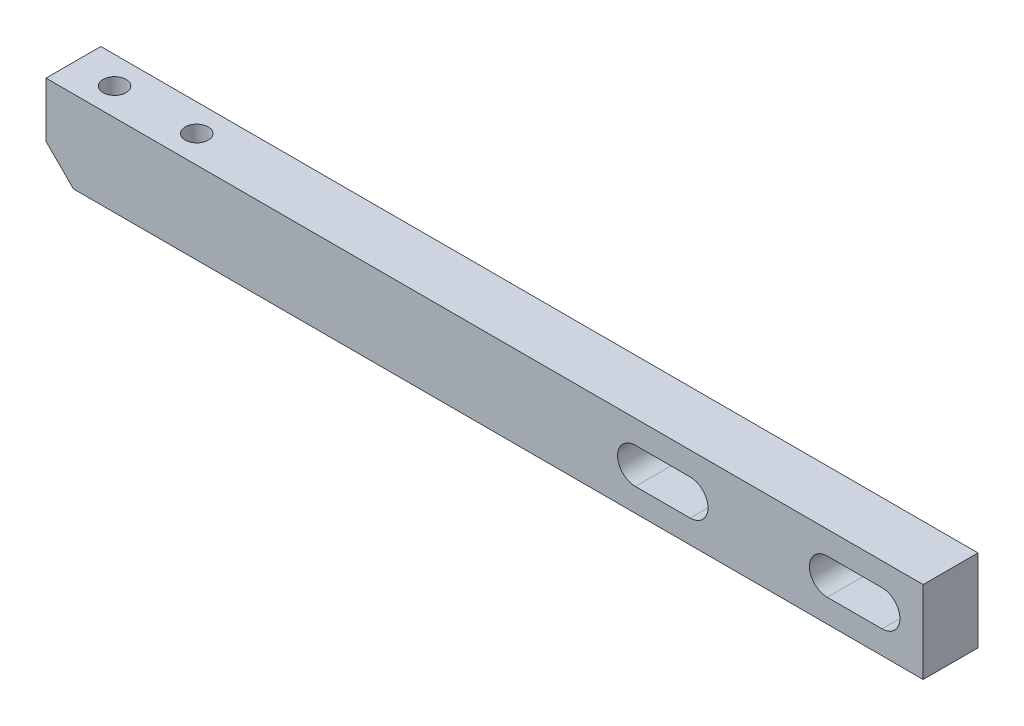
ISO-10303-21;
HEADER;
FILE_DESCRIPTION(('STEP AP214'),'2;1');
FILE_NAME('part.step','',(''),(''),'','','');
FILE_SCHEMA(('AUTOMOTIVE_DESIGN { 1 0 10303 214 1 1 1 1 }'));
ENDSEC;
DATA;
#1=APPLICATION_CONTEXT('core data for automotive mechanical design processes');
#2=APPLICATION_PROTOCOL_DEFINITION('international standard','automotive_design',2000,#1);
#3=PRODUCT_CONTEXT('',#1,'mechanical');
#4=PRODUCT('Part','Part','',(#3));
#5=PRODUCT_RELATED_PRODUCT_CATEGORY('part','',(#4));
#6=PRODUCT_DEFINITION_FORMATION('','',#4);
#7=PRODUCT_DEFINITION_CONTEXT('part definition',#1,'design');
#8=PRODUCT_DEFINITION('design','',#6,#7);
#9=PRODUCT_DEFINITION_SHAPE('','',#8);
#10=(LENGTH_UNIT() NAMED_UNIT(*) SI_UNIT(.MILLI.,.METRE.));
#11=(NAMED_UNIT(*) PLANE_ANGLE_UNIT() SI_UNIT($,.RADIAN.));
#12=(NAMED_UNIT(*) SI_UNIT($,.STERADIAN.) SOLID_ANGLE_UNIT());
#13=UNCERTAINTY_MEASURE_WITH_UNIT(LENGTH_MEASURE(1.E-05),#10,'distance_accuracy_value','');
#14=(GEOMETRIC_REPRESENTATION_CONTEXT(3) GLOBAL_UNCERTAINTY_ASSIGNED_CONTEXT((#13)) GLOBAL_UNIT_ASSIGNED_CONTEXT((#10,
#11,#12)) REPRESENTATION_CONTEXT('',''));
#15=CARTESIAN_POINT('',(0.,0.,0.));
#16=DIRECTION('',(0.,0.,1.));
#17=DIRECTION('',(1.,0.,0.));
#18=AXIS2_PLACEMENT_3D('',#15,#16,#17);
#19=CARTESIAN_POINT('',(0.,0.,10.));
#20=DIRECTION('',(1.,0.,0.));
#21=DIRECTION('',(0.,0.,-1.));
#22=AXIS2_PLACEMENT_3D('',#19,#20,#21);
#23=PLANE('',#22);
#24=DIRECTION('',(0.,-1.,0.));
#25=VECTOR('',#24,1.);
#26=CARTESIAN_POINT('',(0.,0.,0.));
#27=LINE('',#26,#25);
#28=CARTESIAN_POINT('',(0.,15.,0.));
#29=VERTEX_POINT('',#28);
#30=CARTESIAN_POINT('',(0.,5.,0.));
#31=VERTEX_POINT('',#30);
#32=EDGE_CURVE('E219',#29,#31,#27,.T.);
#33=ORIENTED_EDGE('',*,*,#32,.T.);
#34=DIRECTION('',(0.,0.,1.));
#35=VECTOR('',#34,1.);
#36=CARTESIAN_POINT('',(0.,5.,10.));
#37=LINE('',#36,#35);
#38=CARTESIAN_POINT('',(0.,5.,10.));
#39=VERTEX_POINT('',#38);
#40=EDGE_CURVE('E47',#31,#39,#37,.T.);
#41=ORIENTED_EDGE('',*,*,#40,.T.);
#42=DIRECTION('',(0.,-1.,0.));
#43=VECTOR('',#42,1.);
#44=CARTESIAN_POINT('',(0.,0.,10.));
#45=LINE('',#44,#43);
#46=CARTESIAN_POINT('',(0.,15.,10.));
#47=VERTEX_POINT('',#46);
#48=EDGE_CURVE('E220',#47,#39,#45,.T.);
#49=ORIENTED_EDGE('',*,*,#48,.F.);
#50=DIRECTION('',(0.,0.,-1.));
#51=VECTOR('',#50,1.);
#52=CARTESIAN_POINT('',(0.,15.,10.));
#53=LINE('',#52,#51);
#54=EDGE_CURVE('E230',#47,#29,#53,.T.);
#55=ORIENTED_EDGE('',*,*,#54,.T.);
#56=EDGE_LOOP('',(#33,#41,#49,#55));
#57=FACE_BOUND('',#56,.T.);
#58=ADVANCED_FACE('F39',(#57),#23,.F.);
#59=CARTESIAN_POINT('',(0.,0.,10.));
#60=DIRECTION('',(0.,1.,0.));
#61=DIRECTION('',(0.,0.,1.));
#62=AXIS2_PLACEMENT_3D('',#59,#60,#61);
#63=PLANE('',#62);
#64=DIRECTION('',(1.,0.,0.));
#65=VECTOR('',#64,1.);
#66=CARTESIAN_POINT('',(0.,0.,10.));
#67=LINE('',#66,#65);
#68=CARTESIAN_POINT('',(4.99999999999999,0.,10.));
#69=VERTEX_POINT('',#68);
#70=CARTESIAN_POINT('',(160.,0.,10.));
#71=VERTEX_POINT('',#70);
#72=EDGE_CURVE('E223',#69,#71,#67,.T.);
#73=ORIENTED_EDGE('',*,*,#72,.F.);
#74=DIRECTION('',(0.,0.,-1.));
#75=VECTOR('',#74,1.);
#76=CARTESIAN_POINT('',(4.99999999999999,0.,10.));
#77=LINE('',#76,#75);
#78=CARTESIAN_POINT('',(4.99999999999999,0.,0.));
#79=VERTEX_POINT('',#78);
#80=EDGE_CURVE('E246',#69,#79,#77,.T.);
#81=ORIENTED_EDGE('',*,*,#80,.T.);
#82=DIRECTION('',(1.,0.,0.));
#83=VECTOR('',#82,1.);
#84=CARTESIAN_POINT('',(0.,0.,0.));
#85=LINE('',#84,#83);
#86=CARTESIAN_POINT('',(160.,0.,0.));
#87=VERTEX_POINT('',#86);
#88=EDGE_CURVE('E233',#79,#87,#85,.T.);
#89=ORIENTED_EDGE('',*,*,#88,.T.);
#90=DIRECTION('',(0.,0.,-1.));
#91=VECTOR('',#90,1.);
#92=CARTESIAN_POINT('',(160.,0.,10.));
#93=LINE('',#92,#91);
#94=EDGE_CURVE('E243',#71,#87,#93,.T.);
#95=ORIENTED_EDGE('',*,*,#94,.F.);
#96=EDGE_LOOP('',(#73,#81,#89,#95));
#97=FACE_BOUND('',#96,.T.);
#98=ADVANCED_FACE('F263',(#97),#63,.F.);
#99=CARTESIAN_POINT('',(160.,0.,10.));
#100=DIRECTION('',(-1.,0.,0.));
#101=DIRECTION('',(0.,0.,1.));
#102=AXIS2_PLACEMENT_3D('',#99,#100,#101);
#103=PLANE('',#102);
#104=DIRECTION('',(0.,1.,0.));
#105=VECTOR('',#104,1.);
#106=CARTESIAN_POINT('',(160.,0.,0.));
#107=LINE('',#106,#105);
#108=CARTESIAN_POINT('',(160.,15.,0.));
#109=VERTEX_POINT('',#108);
#110=EDGE_CURVE('E235',#87,#109,#107,.T.);
#111=ORIENTED_EDGE('',*,*,#110,.T.);
#112=DIRECTION('',(0.,0.,-1.));
#113=VECTOR('',#112,1.);
#114=CARTESIAN_POINT('',(160.,15.,10.));
#115=LINE('',#114,#113);
#116=CARTESIAN_POINT('',(160.,15.,10.));
#117=VERTEX_POINT('',#116);
#118=EDGE_CURVE('E240',#117,#109,#115,.T.);
#119=ORIENTED_EDGE('',*,*,#118,.F.);
#120=DIRECTION('',(0.,1.,0.));
#121=VECTOR('',#120,1.);
#122=CARTESIAN_POINT('',(160.,0.,10.));
#123=LINE('',#122,#121);
#124=EDGE_CURVE('E226',#71,#117,#123,.T.);
#125=ORIENTED_EDGE('',*,*,#124,.F.);
#126=ORIENTED_EDGE('',*,*,#94,.T.);
#127=EDGE_LOOP('',(#111,#119,#125,#126));
#128=FACE_BOUND('',#127,.T.);
#129=ADVANCED_FACE('F271',(#128),#103,.F.);
#130=CARTESIAN_POINT('',(0.,15.,10.));
#131=DIRECTION('',(0.,-1.,0.));
#132=DIRECTION('',(0.,0.,-1.));
#133=AXIS2_PLACEMENT_3D('',#130,#131,#132);
#134=PLANE('',#133);
#135=CARTESIAN_POINT('',(7.5,15.,5.));
#136=DIRECTION('',(0.,1.,0.));
#137=DIRECTION('',(0.,0.,1.));
#138=AXIS2_PLACEMENT_3D('',#135,#136,#137);
#139=CIRCLE('',#138,2.1);
#140=CARTESIAN_POINT('',(7.5,15.,7.1));
#141=VERTEX_POINT('',#140);
#142=EDGE_CURVE('E201',#141,#141,#139,.T.);
#143=ORIENTED_EDGE('',*,*,#142,.F.);
#144=EDGE_LOOP('',(#143));
#145=FACE_BOUND('',#144,.T.);
#146=CARTESIAN_POINT('',(22.5,15.,5.));
#147=DIRECTION('',(0.,1.,0.));
#148=DIRECTION('',(0.,0.,1.));
#149=AXIS2_PLACEMENT_3D('',#146,#147,#148);
#150=CIRCLE('',#149,2.1);
#151=CARTESIAN_POINT('',(22.5,15.,7.1));
#152=VERTEX_POINT('',#151);
#153=EDGE_CURVE('E213',#152,#152,#150,.T.);
#154=ORIENTED_EDGE('',*,*,#153,.F.);
#155=EDGE_LOOP('',(#154));
#156=FACE_BOUND('',#155,.T.);
#157=DIRECTION('',(-1.,0.,0.));
#158=VECTOR('',#157,1.);
#159=CARTESIAN_POINT('',(0.,15.,0.));
#160=LINE('',#159,#158);
#161=EDGE_CURVE('E224',#109,#29,#160,.T.);
#162=ORIENTED_EDGE('',*,*,#161,.T.);
#163=ORIENTED_EDGE('',*,*,#54,.F.);
#164=DIRECTION('',(-1.,0.,0.));
#165=VECTOR('',#164,1.);
#166=CARTESIAN_POINT('',(0.,15.,10.));
#167=LINE('',#166,#165);
#168=EDGE_CURVE('E228',#117,#47,#167,.T.);
#169=ORIENTED_EDGE('',*,*,#168,.F.);
#170=ORIENTED_EDGE('',*,*,#118,.T.);
#171=EDGE_LOOP('',(#162,#163,#169,#170));
#172=FACE_BOUND('',#171,.T.);
#173=ADVANCED_FACE('F274',(#145,#156,#172),#134,.F.);
#174=CARTESIAN_POINT('',(0.,0.,10.));
#175=DIRECTION('',(0.,0.,-1.));
#176=DIRECTION('',(-1.,0.,0.));
#177=AXIS2_PLACEMENT_3D('',#174,#175,#176);
#178=PLANE('',#177);
#179=DIRECTION('',(1.,0.,0.));
#180=VECTOR('',#179,1.);
#181=CARTESIAN_POINT('',(117.5,10.75,10.));
#182=LINE('',#181,#180);
#183=CARTESIAN_POINT('',(107.5,10.75,10.));
#184=VERTEX_POINT('',#183);
#185=CARTESIAN_POINT('',(117.5,10.75,10.));
#186=VERTEX_POINT('',#185);
#187=EDGE_CURVE('E147',#184,#186,#182,.T.);
#188=ORIENTED_EDGE('',*,*,#187,.T.);
#189=CARTESIAN_POINT('',(117.5,7.5,10.));
#190=DIRECTION('',(0.,0.,-1.));
#191=DIRECTION('',(-1.,0.,0.));
#192=AXIS2_PLACEMENT_3D('',#189,#190,#191);
#193=CIRCLE('',#192,3.25);
#194=CARTESIAN_POINT('',(117.5,4.25,10.));
#195=VERTEX_POINT('',#194);
#196=EDGE_CURVE('E141',#186,#195,#193,.T.);
#197=ORIENTED_EDGE('',*,*,#196,.T.);
#198=DIRECTION('',(-1.,0.,0.));
#199=VECTOR('',#198,1.);
#200=CARTESIAN_POINT('',(117.5,4.25,10.));
#201=LINE('',#200,#199);
#202=CARTESIAN_POINT('',(107.5,4.25000000000001,10.));
#203=VERTEX_POINT('',#202);
#204=EDGE_CURVE('E150',#195,#203,#201,.T.);
#205=ORIENTED_EDGE('',*,*,#204,.T.);
#206=CARTESIAN_POINT('',(107.5,7.5,10.));
#207=DIRECTION('',(0.,0.,-1.));
#208=DIRECTION('',(-1.,0.,0.));
#209=AXIS2_PLACEMENT_3D('',#206,#207,#208);
#210=CIRCLE('',#209,3.25);
#211=EDGE_CURVE('E54',#203,#184,#210,.T.);
#212=ORIENTED_EDGE('',*,*,#211,.T.);
#213=EDGE_LOOP('',(#188,#197,#205,#212));
#214=FACE_BOUND('',#213,.T.);
#215=DIRECTION('',(1.,0.,0.));
#216=VECTOR('',#215,1.);
#217=CARTESIAN_POINT('',(152.5,10.75,10.));
#218=LINE('',#217,#216);
#219=CARTESIAN_POINT('',(142.5,10.75,10.));
#220=VERTEX_POINT('',#219);
#221=CARTESIAN_POINT('',(152.5,10.75,10.));
#222=VERTEX_POINT('',#221);
#223=EDGE_CURVE('E186',#220,#222,#218,.T.);
#224=ORIENTED_EDGE('',*,*,#223,.T.);
#225=CARTESIAN_POINT('',(152.5,7.5,10.));
#226=DIRECTION('',(0.,0.,-1.));
#227=DIRECTION('',(-1.,0.,0.));
#228=AXIS2_PLACEMENT_3D('',#225,#226,#227);
#229=CIRCLE('',#228,3.25);
#230=CARTESIAN_POINT('',(152.5,4.25,10.));
#231=VERTEX_POINT('',#230);
#232=EDGE_CURVE('E176',#222,#231,#229,.T.);
#233=ORIENTED_EDGE('',*,*,#232,.T.);
#234=DIRECTION('',(-1.,0.,0.));
#235=VECTOR('',#234,1.);
#236=CARTESIAN_POINT('',(152.5,4.25,10.));
#237=LINE('',#236,#235);
#238=CARTESIAN_POINT('',(142.5,4.25,10.));
#239=VERTEX_POINT('',#238);
#240=EDGE_CURVE('E179',#231,#239,#237,.T.);
#241=ORIENTED_EDGE('',*,*,#240,.T.);
#242=CARTESIAN_POINT('',(142.5,7.5,10.));
#243=DIRECTION('',(0.,0.,-1.));
#244=DIRECTION('',(-1.,0.,0.));
#245=AXIS2_PLACEMENT_3D('',#242,#243,#244);
#246=CIRCLE('',#245,3.25);
#247=EDGE_CURVE('E183',#239,#220,#246,.T.);
#248=ORIENTED_EDGE('',*,*,#247,.T.);
#249=EDGE_LOOP('',(#224,#233,#241,#248));
#250=FACE_BOUND('',#249,.T.);
#251=ORIENTED_EDGE('',*,*,#48,.T.);
#252=DIRECTION('',(-0.707106781186547,0.707106781186549,0.));
#253=VECTOR('',#252,1.);
#254=CARTESIAN_POINT('',(4.99999999999999,0.,10.));
#255=LINE('',#254,#253);
#256=EDGE_CURVE('E11',#39,#69,#255,.F.);
#257=ORIENTED_EDGE('',*,*,#256,.T.);
#258=ORIENTED_EDGE('',*,*,#72,.T.);
#259=ORIENTED_EDGE('',*,*,#124,.T.);
#260=ORIENTED_EDGE('',*,*,#168,.T.);
#261=EDGE_LOOP('',(#251,#257,#258,#259,#260));
#262=FACE_BOUND('',#261,.T.);
#263=ADVANCED_FACE('F154',(#214,#250,#262),#178,.F.);
#264=CARTESIAN_POINT('',(0.,0.,0.));
#265=DIRECTION('',(0.,0.,-1.));
#266=DIRECTION('',(-1.,0.,0.));
#267=AXIS2_PLACEMENT_3D('',#264,#265,#266);
#268=PLANE('',#267);
#269=CARTESIAN_POINT('',(117.5,7.5,0.));
#270=DIRECTION('',(0.,0.,-1.));
#271=DIRECTION('',(-1.,0.,0.));
#272=AXIS2_PLACEMENT_3D('',#269,#270,#271);
#273=CIRCLE('',#272,3.25);
#274=CARTESIAN_POINT('',(117.5,10.75,0.));
#275=VERTEX_POINT('',#274);
#276=CARTESIAN_POINT('',(117.5,4.25,0.));
#277=VERTEX_POINT('',#276);
#278=EDGE_CURVE('E62',#275,#277,#273,.T.);
#279=ORIENTED_EDGE('',*,*,#278,.F.);
#280=DIRECTION('',(1.,0.,0.));
#281=VECTOR('',#280,1.);
#282=CARTESIAN_POINT('',(117.5,10.75,0.));
#283=LINE('',#282,#281);
#284=CARTESIAN_POINT('',(107.5,10.75,0.));
#285=VERTEX_POINT('',#284);
#286=EDGE_CURVE('E157',#285,#275,#283,.T.);
#287=ORIENTED_EDGE('',*,*,#286,.F.);
#288=CARTESIAN_POINT('',(107.5,7.5,0.));
#289=DIRECTION('',(0.,0.,-1.));
#290=DIRECTION('',(-1.,0.,0.));
#291=AXIS2_PLACEMENT_3D('',#288,#289,#290);
#292=CIRCLE('',#291,3.25);
#293=CARTESIAN_POINT('',(107.5,4.25,0.));
#294=VERTEX_POINT('',#293);
#295=EDGE_CURVE('E160',#294,#285,#292,.T.);
#296=ORIENTED_EDGE('',*,*,#295,.F.);
#297=DIRECTION('',(-1.,0.,0.));
#298=VECTOR('',#297,1.);
#299=CARTESIAN_POINT('',(117.5,4.25,0.));
#300=LINE('',#299,#298);
#301=EDGE_CURVE('E166',#277,#294,#300,.T.);
#302=ORIENTED_EDGE('',*,*,#301,.F.);
#303=EDGE_LOOP('',(#279,#287,#296,#302));
#304=FACE_BOUND('',#303,.T.);
#305=CARTESIAN_POINT('',(152.5,7.5,0.));
#306=DIRECTION('',(0.,0.,-1.));
#307=DIRECTION('',(-1.,0.,0.));
#308=AXIS2_PLACEMENT_3D('',#305,#306,#307);
#309=CIRCLE('',#308,3.25);
#310=CARTESIAN_POINT('',(152.5,10.75,0.));
#311=VERTEX_POINT('',#310);
#312=CARTESIAN_POINT('',(152.5,4.25,0.));
#313=VERTEX_POINT('',#312);
#314=EDGE_CURVE('E172',#311,#313,#309,.T.);
#315=ORIENTED_EDGE('',*,*,#314,.F.);
#316=DIRECTION('',(1.,0.,0.));
#317=VECTOR('',#316,1.);
#318=CARTESIAN_POINT('',(152.5,10.75,0.));
#319=LINE('',#318,#317);
#320=CARTESIAN_POINT('',(142.5,10.75,0.));
#321=VERTEX_POINT('',#320);
#322=EDGE_CURVE('E180',#321,#311,#319,.T.);
#323=ORIENTED_EDGE('',*,*,#322,.F.);
#324=CARTESIAN_POINT('',(142.5,7.5,0.));
#325=DIRECTION('',(0.,0.,-1.));
#326=DIRECTION('',(-1.,0.,0.));
#327=AXIS2_PLACEMENT_3D('',#324,#325,#326);
#328=CIRCLE('',#327,3.25);
#329=CARTESIAN_POINT('',(142.5,4.25,0.));
#330=VERTEX_POINT('',#329);
#331=EDGE_CURVE('E194',#330,#321,#328,.T.);
#332=ORIENTED_EDGE('',*,*,#331,.F.);
#333=DIRECTION('',(-1.,0.,0.));
#334=VECTOR('',#333,1.);
#335=CARTESIAN_POINT('',(152.5,4.25,0.));
#336=LINE('',#335,#334);
#337=EDGE_CURVE('E191',#313,#330,#336,.T.);
#338=ORIENTED_EDGE('',*,*,#337,.F.);
#339=EDGE_LOOP('',(#315,#323,#332,#338));
#340=FACE_BOUND('',#339,.T.);
#341=ORIENTED_EDGE('',*,*,#88,.F.);
#342=DIRECTION('',(0.707106781186547,-0.707106781186549,0.));
#343=VECTOR('',#342,1.);
#344=CARTESIAN_POINT('',(2.5,2.5,0.));
#345=LINE('',#344,#343);
#346=EDGE_CURVE('E249',#79,#31,#345,.F.);
#347=ORIENTED_EDGE('',*,*,#346,.T.);
#348=ORIENTED_EDGE('',*,*,#32,.F.);
#349=ORIENTED_EDGE('',*,*,#161,.F.);
#350=ORIENTED_EDGE('',*,*,#110,.F.);
#351=EDGE_LOOP('',(#341,#347,#348,#349,#350));
#352=FACE_BOUND('',#351,.T.);
#353=ADVANCED_FACE('F267',(#304,#340,#352),#268,.T.);
#354=CARTESIAN_POINT('',(22.5,2.,5.));
#355=DIRECTION('',(0.,1.,0.));
#356=DIRECTION('',(0.,0.,1.));
#357=AXIS2_PLACEMENT_3D('',#354,#355,#356);
#358=CONICAL_SURFACE('',#357,2.1,1.02974425867665);
#359=CARTESIAN_POINT('',(22.5,0.738192700042122,5.));
#360=VERTEX_POINT('',#359);
#361=VERTEX_LOOP('',#360);
#362=FACE_BOUND('',#361,.T.);
#363=CARTESIAN_POINT('',(22.5,2.,5.));
#364=DIRECTION('',(0.,1.,0.));
#365=DIRECTION('',(0.,0.,1.));
#366=AXIS2_PLACEMENT_3D('',#363,#364,#365);
#367=CIRCLE('',#366,2.1);
#368=CARTESIAN_POINT('',(22.5,2.,7.1));
#369=VERTEX_POINT('',#368);
#370=EDGE_CURVE('E216',#369,#369,#367,.T.);
#371=ORIENTED_EDGE('',*,*,#370,.T.);
#372=EDGE_LOOP('',(#371));
#373=FACE_BOUND('',#372,.T.);
#374=ADVANCED_FACE('F309',(#362,#373),#358,.F.);
#375=CARTESIAN_POINT('',(22.5,15.,5.));
#376=DIRECTION('',(0.,1.,0.));
#377=DIRECTION('',(0.,0.,1.));
#378=AXIS2_PLACEMENT_3D('',#375,#376,#377);
#379=CYLINDRICAL_SURFACE('',#378,2.1);
#380=ORIENTED_EDGE('',*,*,#370,.F.);
#381=EDGE_LOOP('',(#380));
#382=FACE_BOUND('',#381,.T.);
#383=ORIENTED_EDGE('',*,*,#153,.T.);
#384=EDGE_LOOP('',(#383));
#385=FACE_BOUND('',#384,.T.);
#386=ADVANCED_FACE('F314',(#382,#385),#379,.F.);
#387=CARTESIAN_POINT('',(7.5,2.,5.));
#388=DIRECTION('',(0.,1.,0.));
#389=DIRECTION('',(0.,0.,1.));
#390=AXIS2_PLACEMENT_3D('',#387,#388,#389);
#391=CONICAL_SURFACE('',#390,2.1,1.02974425867665);
#392=CARTESIAN_POINT('',(7.5,0.738192700042122,5.));
#393=VERTEX_POINT('',#392);
#394=VERTEX_LOOP('',#393);
#395=FACE_BOUND('',#394,.T.);
#396=CARTESIAN_POINT('',(7.5,2.,5.));
#397=DIRECTION('',(0.,1.,0.));
#398=DIRECTION('',(0.,0.,1.));
#399=AXIS2_PLACEMENT_3D('',#396,#397,#398);
#400=CIRCLE('',#399,2.1);
#401=CARTESIAN_POINT('',(7.5,2.,7.1));
#402=VERTEX_POINT('',#401);
#403=EDGE_CURVE('E210',#402,#402,#400,.T.);
#404=ORIENTED_EDGE('',*,*,#403,.T.);
#405=EDGE_LOOP('',(#404));
#406=FACE_BOUND('',#405,.T.);
#407=ADVANCED_FACE('F327',(#395,#406),#391,.F.);
#408=CARTESIAN_POINT('',(7.5,15.,5.));
#409=DIRECTION('',(0.,1.,0.));
#410=DIRECTION('',(0.,0.,1.));
#411=AXIS2_PLACEMENT_3D('',#408,#409,#410);
#412=CYLINDRICAL_SURFACE('',#411,2.1);
#413=ORIENTED_EDGE('',*,*,#403,.F.);
#414=EDGE_LOOP('',(#413));
#415=FACE_BOUND('',#414,.T.);
#416=ORIENTED_EDGE('',*,*,#142,.T.);
#417=EDGE_LOOP('',(#416));
#418=FACE_BOUND('',#417,.T.);
#419=ADVANCED_FACE('F339',(#415,#418),#412,.F.);
#420=CARTESIAN_POINT('',(4.99999999999999,0.,10.));
#421=DIRECTION('',(0.707106781186548,0.707106781186546,0.));
#422=DIRECTION('',(0.,0.,-1.));
#423=AXIS2_PLACEMENT_3D('',#420,#421,#422);
#424=PLANE('',#423);
#425=ORIENTED_EDGE('',*,*,#256,.F.);
#426=ORIENTED_EDGE('',*,*,#40,.F.);
#427=ORIENTED_EDGE('',*,*,#346,.F.);
#428=ORIENTED_EDGE('',*,*,#80,.F.);
#429=EDGE_LOOP('',(#425,#426,#427,#428));
#430=FACE_BOUND('',#429,.T.);
#431=ADVANCED_FACE('F41',(#430),#424,.F.);
#432=CARTESIAN_POINT('',(152.5,7.5,10.));
#433=DIRECTION('',(0.,0.,-1.));
#434=DIRECTION('',(-1.,0.,0.));
#435=AXIS2_PLACEMENT_3D('',#432,#433,#434);
#436=CYLINDRICAL_SURFACE('',#435,3.25);
#437=ORIENTED_EDGE('',*,*,#314,.T.);
#438=DIRECTION('',(0.,0.,-1.));
#439=VECTOR('',#438,1.);
#440=CARTESIAN_POINT('',(152.5,4.25,10.));
#441=LINE('',#440,#439);
#442=EDGE_CURVE('E189',#231,#313,#441,.T.);
#443=ORIENTED_EDGE('',*,*,#442,.F.);
#444=ORIENTED_EDGE('',*,*,#232,.F.);
#445=DIRECTION('',(0.,0.,-1.));
#446=VECTOR('',#445,1.);
#447=CARTESIAN_POINT('',(152.5,10.75,10.));
#448=LINE('',#447,#446);
#449=EDGE_CURVE('E199',#222,#311,#448,.T.);
#450=ORIENTED_EDGE('',*,*,#449,.T.);
#451=EDGE_LOOP('',(#437,#443,#444,#450));
#452=FACE_BOUND('',#451,.T.);
#453=ADVANCED_FACE('F368',(#452),#436,.F.);
#454=CARTESIAN_POINT('',(152.5,10.75,10.));
#455=DIRECTION('',(0.,1.,0.));
#456=DIRECTION('',(0.,0.,1.));
#457=AXIS2_PLACEMENT_3D('',#454,#455,#456);
#458=PLANE('',#457);
#459=ORIENTED_EDGE('',*,*,#322,.T.);
#460=ORIENTED_EDGE('',*,*,#449,.F.);
#461=ORIENTED_EDGE('',*,*,#223,.F.);
#462=DIRECTION('',(0.,0.,-1.));
#463=VECTOR('',#462,1.);
#464=CARTESIAN_POINT('',(142.5,10.75,10.));
#465=LINE('',#464,#463);
#466=EDGE_CURVE('E202',#220,#321,#465,.T.);
#467=ORIENTED_EDGE('',*,*,#466,.T.);
#468=EDGE_LOOP('',(#459,#460,#461,#467));
#469=FACE_BOUND('',#468,.T.);
#470=ADVANCED_FACE('F374',(#469),#458,.F.);
#471=CARTESIAN_POINT('',(142.5,7.5,10.));
#472=DIRECTION('',(0.,0.,-1.));
#473=DIRECTION('',(-1.,0.,0.));
#474=AXIS2_PLACEMENT_3D('',#471,#472,#473);
#475=CYLINDRICAL_SURFACE('',#474,3.25);
#476=ORIENTED_EDGE('',*,*,#331,.T.);
#477=ORIENTED_EDGE('',*,*,#466,.F.);
#478=ORIENTED_EDGE('',*,*,#247,.F.);
#479=DIRECTION('',(0.,0.,-1.));
#480=VECTOR('',#479,1.);
#481=CARTESIAN_POINT('',(142.5,4.25,10.));
#482=LINE('',#481,#480);
#483=EDGE_CURVE('E204',#239,#330,#482,.T.);
#484=ORIENTED_EDGE('',*,*,#483,.T.);
#485=EDGE_LOOP('',(#476,#477,#478,#484));
#486=FACE_BOUND('',#485,.T.);
#487=ADVANCED_FACE('F383',(#486),#475,.F.);
#488=CARTESIAN_POINT('',(152.5,4.25,10.));
#489=DIRECTION('',(0.,-1.,0.));
#490=DIRECTION('',(1.,0.,0.));
#491=AXIS2_PLACEMENT_3D('',#488,#489,#490);
#492=PLANE('',#491);
#493=ORIENTED_EDGE('',*,*,#337,.T.);
#494=ORIENTED_EDGE('',*,*,#483,.F.);
#495=ORIENTED_EDGE('',*,*,#240,.F.);
#496=ORIENTED_EDGE('',*,*,#442,.T.);
#497=EDGE_LOOP('',(#493,#494,#495,#496));
#498=FACE_BOUND('',#497,.T.);
#499=ADVANCED_FACE('F391',(#498),#492,.F.);
#500=CARTESIAN_POINT('',(117.5,7.5,10.));
#501=DIRECTION('',(0.,0.,-1.));
#502=DIRECTION('',(-1.,0.,0.));
#503=AXIS2_PLACEMENT_3D('',#500,#501,#502);
#504=CYLINDRICAL_SURFACE('',#503,3.25);
#505=ORIENTED_EDGE('',*,*,#278,.T.);
#506=DIRECTION('',(0.,0.,-1.));
#507=VECTOR('',#506,1.);
#508=CARTESIAN_POINT('',(117.5,4.25,10.));
#509=LINE('',#508,#507);
#510=EDGE_CURVE('E137',#195,#277,#509,.T.);
#511=ORIENTED_EDGE('',*,*,#510,.F.);
#512=ORIENTED_EDGE('',*,*,#196,.F.);
#513=DIRECTION('',(0.,0.,-1.));
#514=VECTOR('',#513,1.);
#515=CARTESIAN_POINT('',(117.5,10.75,10.));
#516=LINE('',#515,#514);
#517=EDGE_CURVE('E170',#186,#275,#516,.T.);
#518=ORIENTED_EDGE('',*,*,#517,.T.);
#519=EDGE_LOOP('',(#505,#511,#512,#518));
#520=FACE_BOUND('',#519,.T.);
#521=ADVANCED_FACE('F139',(#520),#504,.F.);
#522=CARTESIAN_POINT('',(117.5,10.75,10.));
#523=DIRECTION('',(0.,1.,0.));
#524=DIRECTION('',(-1.,0.,0.));
#525=AXIS2_PLACEMENT_3D('',#522,#523,#524);
#526=PLANE('',#525);
#527=ORIENTED_EDGE('',*,*,#286,.T.);
#528=ORIENTED_EDGE('',*,*,#517,.F.);
#529=ORIENTED_EDGE('',*,*,#187,.F.);
#530=DIRECTION('',(0.,0.,-1.));
#531=VECTOR('',#530,1.);
#532=CARTESIAN_POINT('',(107.5,10.75,10.));
#533=LINE('',#532,#531);
#534=EDGE_CURVE('E173',#184,#285,#533,.T.);
#535=ORIENTED_EDGE('',*,*,#534,.T.);
#536=EDGE_LOOP('',(#527,#528,#529,#535));
#537=FACE_BOUND('',#536,.T.);
#538=ADVANCED_FACE('F406',(#537),#526,.F.);
#539=CARTESIAN_POINT('',(107.5,7.5,10.));
#540=DIRECTION('',(0.,0.,-1.));
#541=DIRECTION('',(-1.,0.,0.));
#542=AXIS2_PLACEMENT_3D('',#539,#540,#541);
#543=CYLINDRICAL_SURFACE('',#542,3.25);
#544=ORIENTED_EDGE('',*,*,#295,.T.);
#545=ORIENTED_EDGE('',*,*,#534,.F.);
#546=ORIENTED_EDGE('',*,*,#211,.F.);
#547=DIRECTION('',(0.,0.,-1.));
#548=VECTOR('',#547,1.);
#549=CARTESIAN_POINT('',(107.5,4.25,10.));
#550=LINE('',#549,#548);
#551=EDGE_CURVE('E146',#203,#294,#550,.T.);
#552=ORIENTED_EDGE('',*,*,#551,.T.);
#553=EDGE_LOOP('',(#544,#545,#546,#552));
#554=FACE_BOUND('',#553,.T.);
#555=ADVANCED_FACE('F413',(#554),#543,.F.);
#556=CARTESIAN_POINT('',(117.5,4.25,10.));
#557=DIRECTION('',(0.,-1.,0.));
#558=DIRECTION('',(1.,0.,0.));
#559=AXIS2_PLACEMENT_3D('',#556,#557,#558);
#560=PLANE('',#559);
#561=ORIENTED_EDGE('',*,*,#301,.T.);
#562=ORIENTED_EDGE('',*,*,#551,.F.);
#563=ORIENTED_EDGE('',*,*,#204,.F.);
#564=ORIENTED_EDGE('',*,*,#510,.T.);
#565=EDGE_LOOP('',(#561,#562,#563,#564));
#566=FACE_BOUND('',#565,.T.);
#567=ADVANCED_FACE('F151',(#566),#560,.F.);
#568=CLOSED_SHELL('',(#58,#98,#129,#173,#263,#353,#374,#386,#407,#419,#431,#453,#470,#487,#499,
#521,#538,#555,#567));
#569=MANIFOLD_SOLID_BREP('B2',#568);
#570=ADVANCED_BREP_SHAPE_REPRESENTATION('',(#18,#569),#14);
#571=SHAPE_DEFINITION_REPRESENTATION(#9,#570);
ENDSEC;
END-ISO-10303-21;
